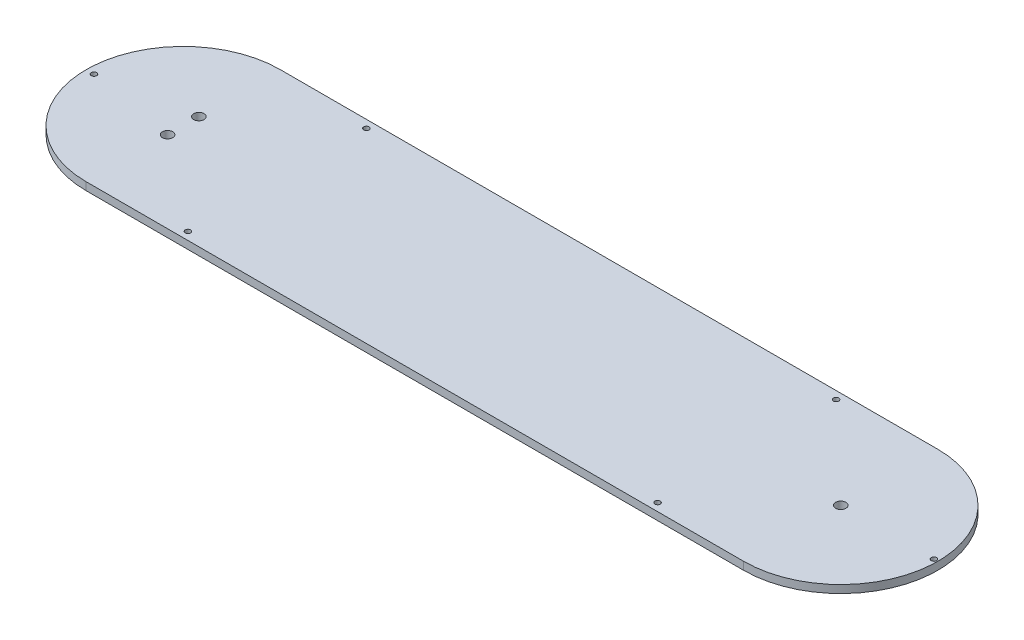
ISO-10303-21;
HEADER;
FILE_DESCRIPTION(('STEP AP214'),'2;1');
FILE_NAME('part.step','',(''),(''),'','','');
FILE_SCHEMA(('AUTOMOTIVE_DESIGN { 1 0 10303 214 1 1 1 1 }'));
ENDSEC;
DATA;
#1=APPLICATION_CONTEXT('core data for automotive mechanical design processes');
#2=APPLICATION_PROTOCOL_DEFINITION('international standard','automotive_design',2000,#1);
#3=PRODUCT_CONTEXT('',#1,'mechanical');
#4=PRODUCT('Part','Part','',(#3));
#5=PRODUCT_RELATED_PRODUCT_CATEGORY('part','',(#4));
#6=PRODUCT_DEFINITION_FORMATION('','',#4);
#7=PRODUCT_DEFINITION_CONTEXT('part definition',#1,'design');
#8=PRODUCT_DEFINITION('design','',#6,#7);
#9=PRODUCT_DEFINITION_SHAPE('','',#8);
#10=(LENGTH_UNIT() NAMED_UNIT(*) SI_UNIT(.MILLI.,.METRE.));
#11=(NAMED_UNIT(*) PLANE_ANGLE_UNIT() SI_UNIT($,.RADIAN.));
#12=(NAMED_UNIT(*) SI_UNIT($,.STERADIAN.) SOLID_ANGLE_UNIT());
#13=UNCERTAINTY_MEASURE_WITH_UNIT(LENGTH_MEASURE(1.E-05),#10,'distance_accuracy_value','');
#14=(GEOMETRIC_REPRESENTATION_CONTEXT(3) GLOBAL_UNCERTAINTY_ASSIGNED_CONTEXT((#13)) GLOBAL_UNIT_ASSIGNED_CONTEXT((#10,
#11,#12)) REPRESENTATION_CONTEXT('',''));
#15=CARTESIAN_POINT('',(0.,0.,0.));
#16=DIRECTION('',(0.,0.,1.));
#17=DIRECTION('',(1.,0.,0.));
#18=AXIS2_PLACEMENT_3D('',#15,#16,#17);
#19=CARTESIAN_POINT('',(0.,3.175,0.));
#20=DIRECTION('',(0.,1.,0.));
#21=DIRECTION('',(0.,0.,1.));
#22=AXIS2_PLACEMENT_3D('',#19,#20,#21);
#23=PLANE('',#22);
#24=CARTESIAN_POINT('',(0.,3.175,6.35));
#25=DIRECTION('',(0.,1.,0.));
#26=DIRECTION('',(0.,0.,1.));
#27=AXIS2_PLACEMENT_3D('',#24,#25,#26);
#28=CIRCLE('',#27,2.1);
#29=CARTESIAN_POINT('',(0.,3.175,8.45));
#30=VERTEX_POINT('',#29);
#31=EDGE_CURVE('E151',#30,#30,#28,.T.);
#32=ORIENTED_EDGE('',*,*,#31,.F.);
#33=EDGE_LOOP('',(#32));
#34=FACE_BOUND('',#33,.T.);
#35=CARTESIAN_POINT('',(304.4825,3.175,0.));
#36=DIRECTION('',(0.,1.,0.));
#37=DIRECTION('',(0.,0.,1.));
#38=AXIS2_PLACEMENT_3D('',#35,#36,#37);
#39=CIRCLE('',#38,1.09220000000001);
#40=CARTESIAN_POINT('',(304.4825,3.175,1.09220000000001));
#41=VERTEX_POINT('',#40);
#42=EDGE_CURVE('E139',#41,#41,#39,.T.);
#43=ORIENTED_EDGE('',*,*,#42,.F.);
#44=EDGE_LOOP('',(#43));
#45=FACE_BOUND('',#44,.T.);
#46=CARTESIAN_POINT('',(228.6,3.175,36.195));
#47=DIRECTION('',(0.,1.,0.));
#48=DIRECTION('',(0.,0.,-1.));
#49=AXIS2_PLACEMENT_3D('',#46,#47,#48);
#50=CIRCLE('',#49,1.09219999999998);
#51=CARTESIAN_POINT('',(228.6,3.175,35.1028));
#52=VERTEX_POINT('',#51);
#53=EDGE_CURVE('E127',#52,#52,#50,.T.);
#54=ORIENTED_EDGE('',*,*,#53,.F.);
#55=EDGE_LOOP('',(#54));
#56=FACE_BOUND('',#55,.T.);
#57=CARTESIAN_POINT('',(228.6,3.175,-36.195));
#58=DIRECTION('',(0.,1.,0.));
#59=DIRECTION('',(0.,0.,1.));
#60=AXIS2_PLACEMENT_3D('',#57,#58,#59);
#61=CIRCLE('',#60,1.09219999999998);
#62=CARTESIAN_POINT('',(228.6,3.175,-35.1028));
#63=VERTEX_POINT('',#62);
#64=EDGE_CURVE('E115',#63,#63,#61,.T.);
#65=ORIENTED_EDGE('',*,*,#64,.F.);
#66=EDGE_LOOP('',(#65));
#67=FACE_BOUND('',#66,.T.);
#68=CARTESIAN_POINT('',(0.,3.175,0.));
#69=DIRECTION('',(0.,1.,0.));
#70=DIRECTION('',(0.,0.,1.));
#71=AXIS2_PLACEMENT_3D('',#68,#69,#70);
#72=CIRCLE('',#71,39.37);
#73=CARTESIAN_POINT('',(0.,3.175,-39.37));
#74=VERTEX_POINT('',#73);
#75=CARTESIAN_POINT('',(0.,3.175,39.37));
#76=VERTEX_POINT('',#75);
#77=EDGE_CURVE('E85',#74,#76,#72,.T.);
#78=ORIENTED_EDGE('',*,*,#77,.T.);
#79=DIRECTION('',(1.,0.,0.));
#80=VECTOR('',#79,1.);
#81=CARTESIAN_POINT('',(0.,3.175,39.37));
#82=LINE('',#81,#80);
#83=CARTESIAN_POINT('',(266.7,3.175,39.37));
#84=VERTEX_POINT('',#83);
#85=EDGE_CURVE('E80',#76,#84,#82,.T.);
#86=ORIENTED_EDGE('',*,*,#85,.T.);
#87=CARTESIAN_POINT('',(266.7,3.175,0.));
#88=DIRECTION('',(0.,1.,0.));
#89=DIRECTION('',(0.,0.,1.));
#90=AXIS2_PLACEMENT_3D('',#87,#88,#89);
#91=CIRCLE('',#90,39.37);
#92=CARTESIAN_POINT('',(266.7,3.175,-39.37));
#93=VERTEX_POINT('',#92);
#94=EDGE_CURVE('E83',#84,#93,#91,.T.);
#95=ORIENTED_EDGE('',*,*,#94,.T.);
#96=DIRECTION('',(-1.,0.,0.));
#97=VECTOR('',#96,1.);
#98=CARTESIAN_POINT('',(0.,3.175,-39.37));
#99=LINE('',#98,#97);
#100=EDGE_CURVE('E50',#93,#74,#99,.T.);
#101=ORIENTED_EDGE('',*,*,#100,.T.);
#102=EDGE_LOOP('',(#78,#86,#95,#101));
#103=FACE_BOUND('',#102,.T.);
#104=CARTESIAN_POINT('',(38.1,3.175,-36.195));
#105=DIRECTION('',(0.,1.,0.));
#106=DIRECTION('',(0.,0.,1.));
#107=AXIS2_PLACEMENT_3D('',#104,#105,#106);
#108=CIRCLE('',#107,1.0922);
#109=CARTESIAN_POINT('',(38.1,3.175,-35.1028));
#110=VERTEX_POINT('',#109);
#111=EDGE_CURVE('E100',#110,#110,#108,.T.);
#112=ORIENTED_EDGE('',*,*,#111,.F.);
#113=EDGE_LOOP('',(#112));
#114=FACE_BOUND('',#113,.T.);
#115=CARTESIAN_POINT('',(38.1,3.175,36.195));
#116=DIRECTION('',(0.,1.,0.));
#117=DIRECTION('',(0.,0.,-1.));
#118=AXIS2_PLACEMENT_3D('',#115,#116,#117);
#119=CIRCLE('',#118,1.0922);
#120=CARTESIAN_POINT('',(38.1,3.175,35.1028));
#121=VERTEX_POINT('',#120);
#122=EDGE_CURVE('E121',#121,#121,#119,.T.);
#123=ORIENTED_EDGE('',*,*,#122,.F.);
#124=EDGE_LOOP('',(#123));
#125=FACE_BOUND('',#124,.T.);
#126=CARTESIAN_POINT('',(-36.195,3.175,0.));
#127=DIRECTION('',(0.,1.,0.));
#128=DIRECTION('',(0.,0.,1.));
#129=AXIS2_PLACEMENT_3D('',#126,#127,#128);
#130=CIRCLE('',#129,1.0922);
#131=CARTESIAN_POINT('',(-36.195,3.175,1.0922));
#132=VERTEX_POINT('',#131);
#133=EDGE_CURVE('E133',#132,#132,#130,.T.);
#134=ORIENTED_EDGE('',*,*,#133,.F.);
#135=EDGE_LOOP('',(#134));
#136=FACE_BOUND('',#135,.T.);
#137=CARTESIAN_POINT('',(266.7,3.175,0.));
#138=DIRECTION('',(0.,1.,0.));
#139=DIRECTION('',(0.,0.,1.));
#140=AXIS2_PLACEMENT_3D('',#137,#138,#139);
#141=CIRCLE('',#140,2.09999999999999);
#142=CARTESIAN_POINT('',(266.7,3.175,2.09999999999999));
#143=VERTEX_POINT('',#142);
#144=EDGE_CURVE('E145',#143,#143,#141,.T.);
#145=ORIENTED_EDGE('',*,*,#144,.F.);
#146=EDGE_LOOP('',(#145));
#147=FACE_BOUND('',#146,.T.);
#148=CARTESIAN_POINT('',(0.,3.175,-6.35));
#149=DIRECTION('',(0.,1.,0.));
#150=DIRECTION('',(0.,0.,1.));
#151=AXIS2_PLACEMENT_3D('',#148,#149,#150);
#152=CIRCLE('',#151,2.1);
#153=CARTESIAN_POINT('',(0.,3.175,-4.25));
#154=VERTEX_POINT('',#153);
#155=EDGE_CURVE('E157',#154,#154,#152,.T.);
#156=ORIENTED_EDGE('',*,*,#155,.F.);
#157=EDGE_LOOP('',(#156));
#158=FACE_BOUND('',#157,.T.);
#159=ADVANCED_FACE('F33',(#34,#45,#56,#67,#103,#114,#125,#136,#147,#158),#23,.T.);
#160=CARTESIAN_POINT('',(0.,0.,0.));
#161=DIRECTION('',(0.,1.,0.));
#162=DIRECTION('',(0.,0.,1.));
#163=AXIS2_PLACEMENT_3D('',#160,#161,#162);
#164=PLANE('',#163);
#165=CARTESIAN_POINT('',(0.,0.,6.35));
#166=DIRECTION('',(0.,1.,0.));
#167=DIRECTION('',(0.,0.,1.));
#168=AXIS2_PLACEMENT_3D('',#165,#166,#167);
#169=CIRCLE('',#168,2.1);
#170=CARTESIAN_POINT('',(0.,0.,8.45));
#171=VERTEX_POINT('',#170);
#172=EDGE_CURVE('E154',#171,#171,#169,.T.);
#173=ORIENTED_EDGE('',*,*,#172,.T.);
#174=EDGE_LOOP('',(#173));
#175=FACE_BOUND('',#174,.T.);
#176=CARTESIAN_POINT('',(304.4825,0.,0.));
#177=DIRECTION('',(0.,1.,0.));
#178=DIRECTION('',(0.,0.,1.));
#179=AXIS2_PLACEMENT_3D('',#176,#177,#178);
#180=CIRCLE('',#179,1.09220000000001);
#181=CARTESIAN_POINT('',(304.4825,0.,1.09220000000001));
#182=VERTEX_POINT('',#181);
#183=EDGE_CURVE('E142',#182,#182,#180,.T.);
#184=ORIENTED_EDGE('',*,*,#183,.T.);
#185=EDGE_LOOP('',(#184));
#186=FACE_BOUND('',#185,.T.);
#187=CARTESIAN_POINT('',(228.6,0.,36.195));
#188=DIRECTION('',(0.,1.,0.));
#189=DIRECTION('',(0.,0.,-1.));
#190=AXIS2_PLACEMENT_3D('',#187,#188,#189);
#191=CIRCLE('',#190,1.09219999999998);
#192=CARTESIAN_POINT('',(228.6,0.,35.1028));
#193=VERTEX_POINT('',#192);
#194=EDGE_CURVE('E130',#193,#193,#191,.T.);
#195=ORIENTED_EDGE('',*,*,#194,.T.);
#196=EDGE_LOOP('',(#195));
#197=FACE_BOUND('',#196,.T.);
#198=CARTESIAN_POINT('',(228.6,0.,-36.195));
#199=DIRECTION('',(0.,1.,0.));
#200=DIRECTION('',(0.,0.,1.));
#201=AXIS2_PLACEMENT_3D('',#198,#199,#200);
#202=CIRCLE('',#201,1.09219999999998);
#203=CARTESIAN_POINT('',(228.6,0.,-35.1028));
#204=VERTEX_POINT('',#203);
#205=EDGE_CURVE('E118',#204,#204,#202,.T.);
#206=ORIENTED_EDGE('',*,*,#205,.T.);
#207=EDGE_LOOP('',(#206));
#208=FACE_BOUND('',#207,.T.);
#209=CARTESIAN_POINT('',(0.,0.,0.));
#210=DIRECTION('',(0.,1.,0.));
#211=DIRECTION('',(0.,0.,1.));
#212=AXIS2_PLACEMENT_3D('',#209,#210,#211);
#213=CIRCLE('',#212,39.37);
#214=CARTESIAN_POINT('',(0.,0.,-39.37));
#215=VERTEX_POINT('',#214);
#216=CARTESIAN_POINT('',(0.,0.,39.37));
#217=VERTEX_POINT('',#216);
#218=EDGE_CURVE('E97',#215,#217,#213,.T.);
#219=ORIENTED_EDGE('',*,*,#218,.F.);
#220=DIRECTION('',(-1.,0.,0.));
#221=VECTOR('',#220,1.);
#222=CARTESIAN_POINT('',(0.,0.,-39.37));
#223=LINE('',#222,#221);
#224=CARTESIAN_POINT('',(266.7,0.,-39.37));
#225=VERTEX_POINT('',#224);
#226=EDGE_CURVE('E73',#225,#215,#223,.T.);
#227=ORIENTED_EDGE('',*,*,#226,.F.);
#228=CARTESIAN_POINT('',(266.7,0.,0.));
#229=DIRECTION('',(0.,1.,0.));
#230=DIRECTION('',(0.,0.,1.));
#231=AXIS2_PLACEMENT_3D('',#228,#229,#230);
#232=CIRCLE('',#231,39.37);
#233=CARTESIAN_POINT('',(266.7,0.,39.37));
#234=VERTEX_POINT('',#233);
#235=EDGE_CURVE('E67',#234,#225,#232,.T.);
#236=ORIENTED_EDGE('',*,*,#235,.F.);
#237=DIRECTION('',(1.,0.,0.));
#238=VECTOR('',#237,1.);
#239=CARTESIAN_POINT('',(0.,0.,39.37));
#240=LINE('',#239,#238);
#241=EDGE_CURVE('E89',#217,#234,#240,.T.);
#242=ORIENTED_EDGE('',*,*,#241,.F.);
#243=EDGE_LOOP('',(#219,#227,#236,#242));
#244=FACE_BOUND('',#243,.T.);
#245=CARTESIAN_POINT('',(38.1,0.,-36.195));
#246=DIRECTION('',(0.,1.,0.));
#247=DIRECTION('',(0.,0.,1.));
#248=AXIS2_PLACEMENT_3D('',#245,#246,#247);
#249=CIRCLE('',#248,1.0922);
#250=CARTESIAN_POINT('',(38.1,0.,-35.1028));
#251=VERTEX_POINT('',#250);
#252=EDGE_CURVE('E112',#251,#251,#249,.T.);
#253=ORIENTED_EDGE('',*,*,#252,.T.);
#254=EDGE_LOOP('',(#253));
#255=FACE_BOUND('',#254,.T.);
#256=CARTESIAN_POINT('',(38.1,0.,36.195));
#257=DIRECTION('',(0.,1.,0.));
#258=DIRECTION('',(0.,0.,-1.));
#259=AXIS2_PLACEMENT_3D('',#256,#257,#258);
#260=CIRCLE('',#259,1.0922);
#261=CARTESIAN_POINT('',(38.1,0.,35.1028));
#262=VERTEX_POINT('',#261);
#263=EDGE_CURVE('E124',#262,#262,#260,.T.);
#264=ORIENTED_EDGE('',*,*,#263,.T.);
#265=EDGE_LOOP('',(#264));
#266=FACE_BOUND('',#265,.T.);
#267=CARTESIAN_POINT('',(-36.195,0.,0.));
#268=DIRECTION('',(0.,1.,0.));
#269=DIRECTION('',(0.,0.,1.));
#270=AXIS2_PLACEMENT_3D('',#267,#268,#269);
#271=CIRCLE('',#270,1.0922);
#272=CARTESIAN_POINT('',(-36.195,0.,1.0922));
#273=VERTEX_POINT('',#272);
#274=EDGE_CURVE('E136',#273,#273,#271,.T.);
#275=ORIENTED_EDGE('',*,*,#274,.T.);
#276=EDGE_LOOP('',(#275));
#277=FACE_BOUND('',#276,.T.);
#278=CARTESIAN_POINT('',(266.7,0.,0.));
#279=DIRECTION('',(0.,1.,0.));
#280=DIRECTION('',(0.,0.,1.));
#281=AXIS2_PLACEMENT_3D('',#278,#279,#280);
#282=CIRCLE('',#281,2.09999999999999);
#283=CARTESIAN_POINT('',(266.7,0.,2.09999999999999));
#284=VERTEX_POINT('',#283);
#285=EDGE_CURVE('E148',#284,#284,#282,.T.);
#286=ORIENTED_EDGE('',*,*,#285,.T.);
#287=EDGE_LOOP('',(#286));
#288=FACE_BOUND('',#287,.T.);
#289=CARTESIAN_POINT('',(0.,0.,-6.35));
#290=DIRECTION('',(0.,1.,0.));
#291=DIRECTION('',(0.,0.,1.));
#292=AXIS2_PLACEMENT_3D('',#289,#290,#291);
#293=CIRCLE('',#292,2.1);
#294=CARTESIAN_POINT('',(0.,0.,-4.25));
#295=VERTEX_POINT('',#294);
#296=EDGE_CURVE('E160',#295,#295,#293,.T.);
#297=ORIENTED_EDGE('',*,*,#296,.T.);
#298=EDGE_LOOP('',(#297));
#299=FACE_BOUND('',#298,.T.);
#300=ADVANCED_FACE('F108',(#175,#186,#197,#208,#244,#255,#266,#277,#288,#299),#164,.F.);
#301=CARTESIAN_POINT('',(0.,3.175,0.));
#302=DIRECTION('',(0.,-1.,0.));
#303=DIRECTION('',(0.,0.,-1.));
#304=AXIS2_PLACEMENT_3D('',#301,#302,#303);
#305=CYLINDRICAL_SURFACE('',#304,39.37);
#306=ORIENTED_EDGE('',*,*,#218,.T.);
#307=DIRECTION('',(0.,-1.,0.));
#308=VECTOR('',#307,1.);
#309=CARTESIAN_POINT('',(0.,3.175,39.37));
#310=LINE('',#309,#308);
#311=EDGE_CURVE('E11',#76,#217,#310,.T.);
#312=ORIENTED_EDGE('',*,*,#311,.F.);
#313=ORIENTED_EDGE('',*,*,#77,.F.);
#314=DIRECTION('',(0.,-1.,0.));
#315=VECTOR('',#314,1.);
#316=CARTESIAN_POINT('',(0.,3.175,-39.37));
#317=LINE('',#316,#315);
#318=EDGE_CURVE('E93',#74,#215,#317,.T.);
#319=ORIENTED_EDGE('',*,*,#318,.T.);
#320=EDGE_LOOP('',(#306,#312,#313,#319));
#321=FACE_BOUND('',#320,.T.);
#322=ADVANCED_FACE('F35',(#321),#305,.T.);
#323=CARTESIAN_POINT('',(0.,3.175,39.37));
#324=DIRECTION('',(0.,0.,-1.));
#325=DIRECTION('',(-1.,0.,0.));
#326=AXIS2_PLACEMENT_3D('',#323,#324,#325);
#327=PLANE('',#326);
#328=ORIENTED_EDGE('',*,*,#241,.T.);
#329=DIRECTION('',(0.,-1.,0.));
#330=VECTOR('',#329,1.);
#331=CARTESIAN_POINT('',(266.7,3.175,39.37));
#332=LINE('',#331,#330);
#333=EDGE_CURVE('E42',#84,#234,#332,.T.);
#334=ORIENTED_EDGE('',*,*,#333,.F.);
#335=ORIENTED_EDGE('',*,*,#85,.F.);
#336=ORIENTED_EDGE('',*,*,#311,.T.);
#337=EDGE_LOOP('',(#328,#334,#335,#336));
#338=FACE_BOUND('',#337,.T.);
#339=ADVANCED_FACE('F88',(#338),#327,.F.);
#340=CARTESIAN_POINT('',(266.7,3.175,0.));
#341=DIRECTION('',(0.,-1.,0.));
#342=DIRECTION('',(0.,0.,-1.));
#343=AXIS2_PLACEMENT_3D('',#340,#341,#342);
#344=CYLINDRICAL_SURFACE('',#343,39.37);
#345=ORIENTED_EDGE('',*,*,#235,.T.);
#346=DIRECTION('',(0.,-1.,0.));
#347=VECTOR('',#346,1.);
#348=CARTESIAN_POINT('',(266.7,3.175,-39.37));
#349=LINE('',#348,#347);
#350=EDGE_CURVE('E90',#93,#225,#349,.T.);
#351=ORIENTED_EDGE('',*,*,#350,.F.);
#352=ORIENTED_EDGE('',*,*,#94,.F.);
#353=ORIENTED_EDGE('',*,*,#333,.T.);
#354=EDGE_LOOP('',(#345,#351,#352,#353));
#355=FACE_BOUND('',#354,.T.);
#356=ADVANCED_FACE('F91',(#355),#344,.T.);
#357=CARTESIAN_POINT('',(0.,3.175,-39.37));
#358=DIRECTION('',(0.,0.,1.));
#359=DIRECTION('',(1.,0.,0.));
#360=AXIS2_PLACEMENT_3D('',#357,#358,#359);
#361=PLANE('',#360);
#362=ORIENTED_EDGE('',*,*,#226,.T.);
#363=ORIENTED_EDGE('',*,*,#318,.F.);
#364=ORIENTED_EDGE('',*,*,#100,.F.);
#365=ORIENTED_EDGE('',*,*,#350,.T.);
#366=EDGE_LOOP('',(#362,#363,#364,#365));
#367=FACE_BOUND('',#366,.T.);
#368=ADVANCED_FACE('F105',(#367),#361,.F.);
#369=CARTESIAN_POINT('',(38.1,3.175,-36.195));
#370=DIRECTION('',(0.,-1.,0.));
#371=DIRECTION('',(0.,0.,-1.));
#372=AXIS2_PLACEMENT_3D('',#369,#370,#371);
#373=CYLINDRICAL_SURFACE('',#372,1.0922);
#374=ORIENTED_EDGE('',*,*,#111,.T.);
#375=EDGE_LOOP('',(#374));
#376=FACE_BOUND('',#375,.T.);
#377=ORIENTED_EDGE('',*,*,#252,.F.);
#378=EDGE_LOOP('',(#377));
#379=FACE_BOUND('',#378,.T.);
#380=ADVANCED_FACE('F180',(#376,#379),#373,.F.);
#381=CARTESIAN_POINT('',(228.6,3.175,-36.195));
#382=DIRECTION('',(0.,-1.,0.));
#383=DIRECTION('',(0.,0.,-1.));
#384=AXIS2_PLACEMENT_3D('',#381,#382,#383);
#385=CYLINDRICAL_SURFACE('',#384,1.09219999999998);
#386=ORIENTED_EDGE('',*,*,#64,.T.);
#387=EDGE_LOOP('',(#386));
#388=FACE_BOUND('',#387,.T.);
#389=ORIENTED_EDGE('',*,*,#205,.F.);
#390=EDGE_LOOP('',(#389));
#391=FACE_BOUND('',#390,.T.);
#392=ADVANCED_FACE('F226',(#388,#391),#385,.F.);
#393=CARTESIAN_POINT('',(38.1,3.175,36.195));
#394=DIRECTION('',(0.,-1.,0.));
#395=DIRECTION('',(0.,0.,-1.));
#396=AXIS2_PLACEMENT_3D('',#393,#394,#395);
#397=CYLINDRICAL_SURFACE('',#396,1.0922);
#398=ORIENTED_EDGE('',*,*,#122,.T.);
#399=EDGE_LOOP('',(#398));
#400=FACE_BOUND('',#399,.T.);
#401=ORIENTED_EDGE('',*,*,#263,.F.);
#402=EDGE_LOOP('',(#401));
#403=FACE_BOUND('',#402,.T.);
#404=ADVANCED_FACE('F234',(#400,#403),#397,.F.);
#405=CARTESIAN_POINT('',(228.6,3.175,36.195));
#406=DIRECTION('',(0.,-1.,0.));
#407=DIRECTION('',(0.,0.,-1.));
#408=AXIS2_PLACEMENT_3D('',#405,#406,#407);
#409=CYLINDRICAL_SURFACE('',#408,1.09219999999998);
#410=ORIENTED_EDGE('',*,*,#53,.T.);
#411=EDGE_LOOP('',(#410));
#412=FACE_BOUND('',#411,.T.);
#413=ORIENTED_EDGE('',*,*,#194,.F.);
#414=EDGE_LOOP('',(#413));
#415=FACE_BOUND('',#414,.T.);
#416=ADVANCED_FACE('F242',(#412,#415),#409,.F.);
#417=CARTESIAN_POINT('',(-36.195,3.175,0.));
#418=DIRECTION('',(0.,-1.,0.));
#419=DIRECTION('',(0.,0.,-1.));
#420=AXIS2_PLACEMENT_3D('',#417,#418,#419);
#421=CYLINDRICAL_SURFACE('',#420,1.0922);
#422=ORIENTED_EDGE('',*,*,#133,.T.);
#423=EDGE_LOOP('',(#422));
#424=FACE_BOUND('',#423,.T.);
#425=ORIENTED_EDGE('',*,*,#274,.F.);
#426=EDGE_LOOP('',(#425));
#427=FACE_BOUND('',#426,.T.);
#428=ADVANCED_FACE('F251',(#424,#427),#421,.F.);
#429=CARTESIAN_POINT('',(304.4825,3.175,0.));
#430=DIRECTION('',(0.,-1.,0.));
#431=DIRECTION('',(0.,0.,-1.));
#432=AXIS2_PLACEMENT_3D('',#429,#430,#431);
#433=CYLINDRICAL_SURFACE('',#432,1.09220000000001);
#434=ORIENTED_EDGE('',*,*,#42,.T.);
#435=EDGE_LOOP('',(#434));
#436=FACE_BOUND('',#435,.T.);
#437=ORIENTED_EDGE('',*,*,#183,.F.);
#438=EDGE_LOOP('',(#437));
#439=FACE_BOUND('',#438,.T.);
#440=ADVANCED_FACE('F260',(#436,#439),#433,.F.);
#441=CARTESIAN_POINT('',(266.7,3.175,0.));
#442=DIRECTION('',(0.,-1.,0.));
#443=DIRECTION('',(0.,0.,-1.));
#444=AXIS2_PLACEMENT_3D('',#441,#442,#443);
#445=CYLINDRICAL_SURFACE('',#444,2.09999999999999);
#446=ORIENTED_EDGE('',*,*,#144,.T.);
#447=EDGE_LOOP('',(#446));
#448=FACE_BOUND('',#447,.T.);
#449=ORIENTED_EDGE('',*,*,#285,.F.);
#450=EDGE_LOOP('',(#449));
#451=FACE_BOUND('',#450,.T.);
#452=ADVANCED_FACE('F269',(#448,#451),#445,.F.);
#453=CARTESIAN_POINT('',(0.,3.175,6.35));
#454=DIRECTION('',(0.,-1.,0.));
#455=DIRECTION('',(0.,0.,-1.));
#456=AXIS2_PLACEMENT_3D('',#453,#454,#455);
#457=CYLINDRICAL_SURFACE('',#456,2.1);
#458=ORIENTED_EDGE('',*,*,#31,.T.);
#459=EDGE_LOOP('',(#458));
#460=FACE_BOUND('',#459,.T.);
#461=ORIENTED_EDGE('',*,*,#172,.F.);
#462=EDGE_LOOP('',(#461));
#463=FACE_BOUND('',#462,.T.);
#464=ADVANCED_FACE('F278',(#460,#463),#457,.F.);
#465=CARTESIAN_POINT('',(0.,3.175,-6.35));
#466=DIRECTION('',(0.,-1.,0.));
#467=DIRECTION('',(0.,0.,-1.));
#468=AXIS2_PLACEMENT_3D('',#465,#466,#467);
#469=CYLINDRICAL_SURFACE('',#468,2.1);
#470=ORIENTED_EDGE('',*,*,#155,.T.);
#471=EDGE_LOOP('',(#470));
#472=FACE_BOUND('',#471,.T.);
#473=ORIENTED_EDGE('',*,*,#296,.F.);
#474=EDGE_LOOP('',(#473));
#475=FACE_BOUND('',#474,.T.);
#476=ADVANCED_FACE('F166',(#472,#475),#469,.F.);
#477=CLOSED_SHELL('',(#159,#300,#322,#339,#356,#368,#380,#392,#404,#416,#428,#440,#452,#464,#476));
#478=MANIFOLD_SOLID_BREP('B2',#477);
#479=ADVANCED_BREP_SHAPE_REPRESENTATION('',(#18,#478),#14);
#480=SHAPE_DEFINITION_REPRESENTATION(#9,#479);
ENDSEC;
END-ISO-10303-21;
